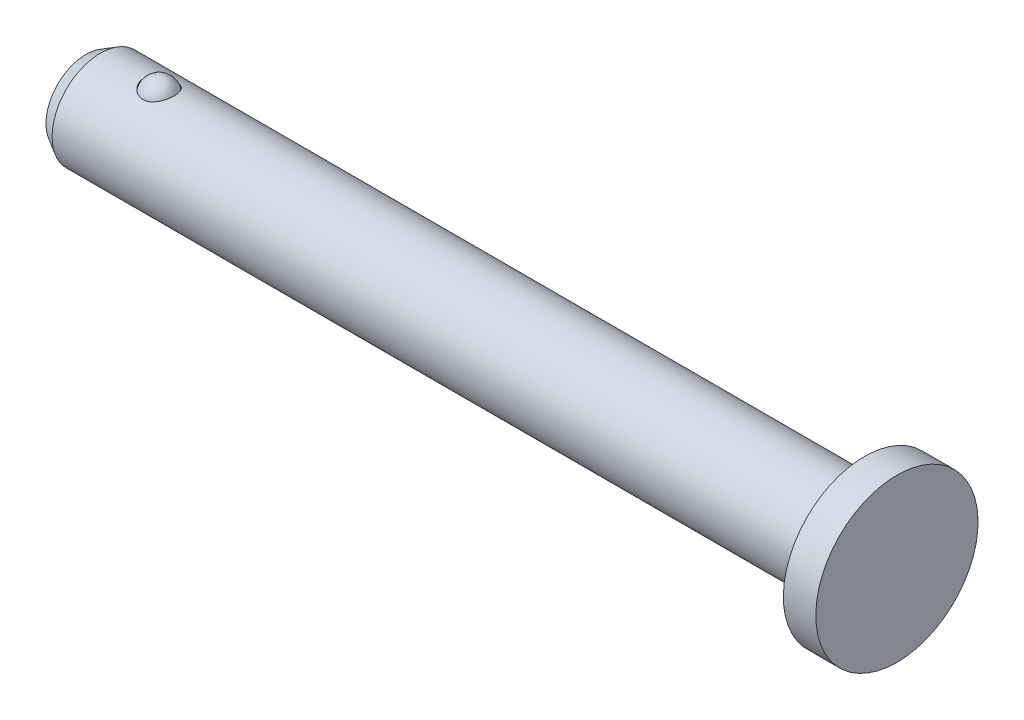
ISO-10303-21;
HEADER;
FILE_DESCRIPTION(('STEP AP214'),'2;1');
FILE_NAME('part.step','',(''),(''),'','','');
FILE_SCHEMA(('AUTOMOTIVE_DESIGN { 1 0 10303 214 1 1 1 1 }'));
ENDSEC;
DATA;
#1=APPLICATION_CONTEXT('core data for automotive mechanical design processes');
#2=APPLICATION_PROTOCOL_DEFINITION('international standard','automotive_design',2000,#1);
#3=PRODUCT_CONTEXT('',#1,'mechanical');
#4=PRODUCT('Part','Part','',(#3));
#5=PRODUCT_RELATED_PRODUCT_CATEGORY('part','',(#4));
#6=PRODUCT_DEFINITION_FORMATION('','',#4);
#7=PRODUCT_DEFINITION_CONTEXT('part definition',#1,'design');
#8=PRODUCT_DEFINITION('design','',#6,#7);
#9=PRODUCT_DEFINITION_SHAPE('','',#8);
#10=(LENGTH_UNIT() NAMED_UNIT(*) SI_UNIT(.MILLI.,.METRE.));
#11=(NAMED_UNIT(*) PLANE_ANGLE_UNIT() SI_UNIT($,.RADIAN.));
#12=(NAMED_UNIT(*) SI_UNIT($,.STERADIAN.) SOLID_ANGLE_UNIT());
#13=UNCERTAINTY_MEASURE_WITH_UNIT(LENGTH_MEASURE(1.E-05),#10,'distance_accuracy_value','');
#14=(GEOMETRIC_REPRESENTATION_CONTEXT(3) GLOBAL_UNCERTAINTY_ASSIGNED_CONTEXT((#13)) GLOBAL_UNIT_ASSIGNED_CONTEXT((#10,
#11,#12)) REPRESENTATION_CONTEXT('',''));
#15=CARTESIAN_POINT('',(0.,0.,0.));
#16=DIRECTION('',(0.,0.,1.));
#17=DIRECTION('',(1.,0.,0.));
#18=AXIS2_PLACEMENT_3D('',#15,#16,#17);
#19=CARTESIAN_POINT('',(-16.26235,2.02985730626251,0.));
#20=DIRECTION('',(-1.,0.,0.));
#21=DIRECTION('',(0.,1.,0.));
#22=AXIS2_PLACEMENT_3D('',#19,#20,#21);
#23=SPHERICAL_SURFACE('',#22,0.789542693737488);
#24=CARTESIAN_POINT('',(-17.0518926937375,2.02985730626251,0.));
#25=VERTEX_POINT('',#24);
#26=VERTEX_LOOP('',#25);
#27=FACE_BOUND('',#26,.T.);
#28=ADVANCED_FACE('F43',(#27),#23,.T.);
#29=CLOSED_SHELL('',(#28));
#30=MANIFOLD_SOLID_BREP('B2',#29);
#31=CARTESIAN_POINT('',(-19.84375,0.,0.));
#32=DIRECTION('',(-1.,0.,0.));
#33=DIRECTION('',(0.,-1.,0.));
#34=AXIS2_PLACEMENT_3D('',#31,#32,#33);
#35=CYLINDRICAL_SURFACE('',#34,2.3622);
#36=CARTESIAN_POINT('',(-19.13509,0.,0.));
#37=DIRECTION('',(-1.,0.,0.));
#38=DIRECTION('',(0.,-1.,0.));
#39=AXIS2_PLACEMENT_3D('',#36,#37,#38);
#40=CIRCLE('',#39,2.3622);
#41=CARTESIAN_POINT('',(-19.13509,-2.3622,0.));
#42=VERTEX_POINT('',#41);
#43=EDGE_CURVE('E68',#42,#42,#40,.T.);
#44=ORIENTED_EDGE('',*,*,#43,.F.);
#45=EDGE_LOOP('',(#44));
#46=FACE_BOUND('',#45,.T.);
#47=CARTESIAN_POINT('',(18.25625,0.,0.));
#48=DIRECTION('',(-1.,0.,0.));
#49=DIRECTION('',(0.,-1.,0.));
#50=AXIS2_PLACEMENT_3D('',#47,#48,#49);
#51=CIRCLE('',#50,2.3622);
#52=CARTESIAN_POINT('',(18.25625,-2.3622,0.));
#53=VERTEX_POINT('',#52);
#54=EDGE_CURVE('E42',#53,#53,#51,.T.);
#55=ORIENTED_EDGE('',*,*,#54,.T.);
#56=EDGE_LOOP('',(#55));
#57=FACE_BOUND('',#56,.T.);
#58=CARTESIAN_POINT('',(-16.26235,2.22581604673215,-0.791032089178223));
#59=CARTESIAN_POINT('',(-16.3018338222643,2.22581576398311,-0.791032519638611));
#60=CARTESIAN_POINT('',(-16.3413151384197,2.22697971671572,-0.787780239460781));
#61=CARTESIAN_POINT('',(-16.4190911852111,2.23149491079169,-0.774896744356571));
#62=CARTESIAN_POINT('',(-16.4573858392533,2.2348462930174,-0.765265118565097));
#63=CARTESIAN_POINT('',(-16.531633713184,2.24333848583653,-0.739997800068514));
#64=CARTESIAN_POINT('',(-16.5675913296129,2.24847581373636,-0.724373786774371));
#65=CARTESIAN_POINT('',(-16.6363604141592,2.25998083212617,-0.687636848342251));
#66=CARTESIAN_POINT('',(-16.6691713829049,2.26634871742328,-0.666523053944659));
#67=CARTESIAN_POINT('',(-16.7319315200548,2.27988127975237,-0.618680689218364));
#68=CARTESIAN_POINT('',(-16.7617565640189,2.28706485050395,-0.591794972427997));
#69=CARTESIAN_POINT('',(-16.8167458077474,2.30133787147743,-0.533600878356361));
#70=CARTESIAN_POINT('',(-16.8419088865026,2.30842729868224,-0.502291440535601));
#71=CARTESIAN_POINT('',(-16.88866080437,2.32229610981989,-0.433849997368858));
#72=CARTESIAN_POINT('',(-16.9099016466427,2.32902369976236,-0.396469482014573));
#73=CARTESIAN_POINT('',(-16.9462545129409,2.34094584755715,-0.318610784362622));
#74=CARTESIAN_POINT('',(-16.9613651181152,2.34614005042941,-0.278131887514646));
#75=CARTESIAN_POINT('',(-16.9857004779035,2.35466270542611,-0.193473280151713));
#76=CARTESIAN_POINT('',(-16.9946653937695,2.35790814356074,-0.149210288520306));
#77=CARTESIAN_POINT('',(-17.005565894284,2.36186996349137,-0.0597154884593794));
#78=CARTESIAN_POINT('',(-17.0075008699652,2.36258612618922,-0.0144835964404185));
#79=CARTESIAN_POINT('',(-17.0042909971991,2.36141021290238,0.0762430533264951));
#80=CARTESIAN_POINT('',(-16.9990605263757,2.35948659277288,0.121734407393892));
#81=CARTESIAN_POINT('',(-16.9814508372294,2.35317206611294,0.211137527329617));
#82=CARTESIAN_POINT('',(-16.9690713024393,2.34878105035866,0.255049223179882));
#83=CARTESIAN_POINT('',(-16.9373785333382,2.33799474034002,0.340003755419018));
#84=CARTESIAN_POINT('',(-16.9180697195014,2.33160072420233,0.381048400920879));
#85=CARTESIAN_POINT('',(-16.8728542738949,2.31749884585933,0.45908762846867));
#86=CARTESIAN_POINT('',(-16.8469476298871,2.30979098121703,0.49608220300213));
#87=CARTESIAN_POINT('',(-16.7895191404422,2.2940716483114,0.564297213422602));
#88=CARTESIAN_POINT('',(-16.7580957761656,2.28606718272386,0.595601988346434));
#89=CARTESIAN_POINT('',(-16.6900563583582,2.27059247122217,0.652119197807015));
#90=CARTESIAN_POINT('',(-16.6534418764304,2.26312206464838,0.677333470010342));
#91=CARTESIAN_POINT('',(-16.5779492741709,2.25001785060625,0.71963628712746));
#92=CARTESIAN_POINT('',(-16.5392775456061,2.24431058256401,0.737069660996988));
#93=CARTESIAN_POINT('',(-16.4592512672778,2.23497292980211,0.764920542936362));
#94=CARTESIAN_POINT('',(-16.4178981594483,2.23134143896186,0.775341788088755));
#95=CARTESIAN_POINT('',(-16.336791790642,2.22680429519513,0.788273335332939));
#96=CARTESIAN_POINT('',(-16.2971273529941,2.2257265947787,0.791283526133024));
#97=CARTESIAN_POINT('',(-16.2178529464748,2.2259171339851,0.790747912230158));
#98=CARTESIAN_POINT('',(-16.1782429675224,2.227184856437,0.787203552820129));
#99=CARTESIAN_POINT('',(-16.101593807461,2.23183155461559,0.773926866318529));
#100=CARTESIAN_POINT('',(-16.0645129744794,2.23513795566731,0.764407057193664));
#101=CARTESIAN_POINT('',(-15.9924941222932,2.24343404277332,0.739703383423264));
#102=CARTESIAN_POINT('',(-15.9575563106065,2.24842389153994,0.724518971254892));
#103=CARTESIAN_POINT('',(-15.8896511257475,2.25973866548061,0.688430400089751));
#104=CARTESIAN_POINT('',(-15.8567728995766,2.26609879126542,0.667369988967335));
#105=CARTESIAN_POINT('',(-15.7948539005421,2.27941389290418,0.620368260180016));
#106=CARTESIAN_POINT('',(-15.7658141812176,2.28636903120949,0.594425607222326));
#107=CARTESIAN_POINT('',(-15.7103363875522,2.30067315029258,0.53650441012868));
#108=CARTESIAN_POINT('',(-15.6841940827522,2.30801802589022,0.504241497413388));
#109=CARTESIAN_POINT('',(-15.6373294223548,2.3219066096982,0.435840003810781));
#110=CARTESIAN_POINT('',(-15.6166085654881,2.32845009610334,0.399700355105055));
#111=CARTESIAN_POINT('',(-15.5799154074514,2.34044485511105,0.32236581590907));
#112=CARTESIAN_POINT('',(-15.5642733166028,2.34581462134006,0.281001264451537));
#113=CARTESIAN_POINT('',(-15.5396525932013,2.35443088539652,0.19612297154861));
#114=CARTESIAN_POINT('',(-15.5306749478103,2.35767706866266,0.152608912728052));
#115=CARTESIAN_POINT('',(-15.5193857562819,2.36177692867522,0.0635170638966755));
#116=CARTESIAN_POINT('',(-15.5172440137684,2.36256964717617,0.017914843369445));
#117=CARTESIAN_POINT('',(-15.520139881845,2.3615088375365,-0.0730313594257119));
#118=CARTESIAN_POINT('',(-15.5251778997728,2.35965515925471,-0.118375326895324));
#119=CARTESIAN_POINT('',(-15.5423917858139,2.35347668943244,-0.20772830543412));
#120=CARTESIAN_POINT('',(-15.5545996260354,2.34914083140647,-0.251730402335729));
#121=CARTESIAN_POINT('',(-15.5859777734291,2.33844323829137,-0.33692140450069));
#122=CARTESIAN_POINT('',(-15.6051483348,2.33208142923882,-0.378110206989595));
#123=CARTESIAN_POINT('',(-15.6499743354645,2.31806542607961,-0.45620965136972));
#124=CARTESIAN_POINT('',(-15.6755888264204,2.31041949036449,-0.49314523746102));
#125=CARTESIAN_POINT('',(-15.7328670809521,2.29467177360045,-0.561885478042449));
#126=CARTESIAN_POINT('',(-15.7645302727704,2.28657003568757,-0.593690616967873));
#127=CARTESIAN_POINT('',(-15.8321103675284,2.27114006586694,-0.65018826947417));
#128=CARTESIAN_POINT('',(-15.8678630627565,2.26379555842983,-0.675072287191635));
#129=CARTESIAN_POINT('',(-15.9434509291089,2.25051576769323,-0.718107031490447));
#130=CARTESIAN_POINT('',(-15.9832838483709,2.24457971300892,-0.736261446834665));
#131=CARTESIAN_POINT('',(-16.0625351985796,2.23529527948482,-0.763964093369265));
#132=CARTESIAN_POINT('',(-16.1017351816544,2.2317787962283,-0.774081433169419));
#133=CARTESIAN_POINT('',(-16.1814079558051,2.22703972798425,-0.787614032349746));
#134=CARTESIAN_POINT('',(-16.221880294314,2.22581633654123,-0.791031647969541));
#135=CARTESIAN_POINT('',(-16.26235,2.22581604673215,-0.791032089178223));
#136=B_SPLINE_CURVE_WITH_KNOTS('',3,(#58,#59,#60,#61,#62,#63,#64,#65,#66,#67,#68,#69,#70,#71,
#72,#73,#74,#75,#76,#77,#78,#79,#80,#81,#82,#83,#84,#85,#86,#87,#88,#89,#90,#91,#92,#93,#94,#95,
#96,#97,#98,#99,#100,#101,#102,#103,#104,#105,#106,#107,#108,#109,#110,#111,#112,#113,#114,#115,
#116,#117,#118,#119,#120,#121,#122,#123,#124,#125,#126,#127,#128,#129,#130,#131,#132,#133,#134,
#135),.UNSPECIFIED.,.T.,.F.,(4,2,2,2,2,2,2,2,2,2,2,2,2,2,2,2,2,2,2,2,2,2,2,2,2,2,2,2,2,2,2,2,2,
2,2,2,2,2,4),(0.,0.118299361509042,0.23660634289136,0.354683901324836,0.472780167721935,
0.594630449676355,0.71650999364796,0.846477480289193,0.976475030932804,1.1116766565592,
1.24688999372125,1.38373321192028,1.52058248821508,1.65734461742628,1.79410700031297,
1.92863866932186,2.06312969570308,2.19085824756083,2.31851867302865,2.43729849240827,
2.55605212369601,2.6708045306772,2.78556803214263,2.90373452362426,3.02193338072497,
3.14788853933123,3.27387848087818,3.40691156896659,3.53996435847092,3.67629744685247,
3.81263827028837,3.94959173936421,4.08655020891101,4.22265943045033,4.35875579253439,
4.49059132495187,4.62235448583304,4.74365036609798,4.86490357990958),.UNSPECIFIED.);
#137=CARTESIAN_POINT('',(-16.26235,2.22581604673215,-0.791032089178223));
#138=VERTEX_POINT('',#137);
#139=EDGE_CURVE('E60',#138,#138,#136,.T.);
#140=ORIENTED_EDGE('',*,*,#139,.F.);
#141=EDGE_LOOP('',(#140));
#142=FACE_BOUND('',#141,.T.);
#143=ADVANCED_FACE('F56',(#46,#57,#142),#35,.T.);
#144=CARTESIAN_POINT('',(18.25625,2.3622,0.));
#145=DIRECTION('',(1.,0.,0.));
#146=DIRECTION('',(0.,1.,0.));
#147=AXIS2_PLACEMENT_3D('',#144,#145,#146);
#148=PLANE('',#147);
#149=ORIENTED_EDGE('',*,*,#54,.F.);
#150=EDGE_LOOP('',(#149));
#151=FACE_BOUND('',#150,.T.);
#152=CARTESIAN_POINT('',(18.25625,0.,0.));
#153=DIRECTION('',(-1.,0.,0.));
#154=DIRECTION('',(0.,-1.,0.));
#155=AXIS2_PLACEMENT_3D('',#152,#153,#154);
#156=CIRCLE('',#155,3.96874999999999);
#157=CARTESIAN_POINT('',(18.25625,-3.96874999999999,0.));
#158=VERTEX_POINT('',#157);
#159=EDGE_CURVE('E80',#158,#158,#156,.T.);
#160=ORIENTED_EDGE('',*,*,#159,.T.);
#161=EDGE_LOOP('',(#160));
#162=FACE_BOUND('',#161,.T.);
#163=ADVANCED_FACE('F58',(#151,#162),#148,.F.);
#164=CARTESIAN_POINT('',(-19.13509,0.,0.));
#165=DIRECTION('',(1.,0.,0.));
#166=DIRECTION('',(0.,1.,0.));
#167=AXIS2_PLACEMENT_3D('',#164,#165,#166);
#168=CONICAL_SURFACE('',#167,2.3622,0.523598775598301);
#169=CARTESIAN_POINT('',(-19.84375,0.,0.));
#170=DIRECTION('',(-1.,0.,0.));
#171=DIRECTION('',(0.,-1.,0.));
#172=AXIS2_PLACEMENT_3D('',#169,#170,#171);
#173=CIRCLE('',#172,1.95305495823607);
#174=CARTESIAN_POINT('',(-19.84375,-1.95305495823607,0.));
#175=VERTEX_POINT('',#174);
#176=EDGE_CURVE('E72',#175,#175,#173,.T.);
#177=ORIENTED_EDGE('',*,*,#176,.F.);
#178=EDGE_LOOP('',(#177));
#179=FACE_BOUND('',#178,.T.);
#180=ORIENTED_EDGE('',*,*,#43,.T.);
#181=EDGE_LOOP('',(#180));
#182=FACE_BOUND('',#181,.T.);
#183=ADVANCED_FACE('F94',(#179,#182),#168,.T.);
#184=CARTESIAN_POINT('',(-19.84375,1.95305495823607,0.));
#185=DIRECTION('',(1.,0.,0.));
#186=DIRECTION('',(0.,1.,0.));
#187=AXIS2_PLACEMENT_3D('',#184,#185,#186);
#188=PLANE('',#187);
#189=ORIENTED_EDGE('',*,*,#176,.T.);
#190=EDGE_LOOP('',(#189));
#191=FACE_BOUND('',#190,.T.);
#192=ADVANCED_FACE('F101',(#191),#188,.F.);
#193=CARTESIAN_POINT('',(19.84375,3.96874999999999,0.));
#194=DIRECTION('',(-1.,0.,0.));
#195=DIRECTION('',(0.,-1.,0.));
#196=AXIS2_PLACEMENT_3D('',#193,#194,#195);
#197=PLANE('',#196);
#198=CARTESIAN_POINT('',(19.84375,0.,0.));
#199=DIRECTION('',(-1.,0.,0.));
#200=DIRECTION('',(0.,-1.,0.));
#201=AXIS2_PLACEMENT_3D('',#198,#199,#200);
#202=CIRCLE('',#201,3.96874999999999);
#203=CARTESIAN_POINT('',(19.84375,-3.96874999999999,0.));
#204=VERTEX_POINT('',#203);
#205=EDGE_CURVE('E77',#204,#204,#202,.T.);
#206=ORIENTED_EDGE('',*,*,#205,.F.);
#207=EDGE_LOOP('',(#206));
#208=FACE_BOUND('',#207,.T.);
#209=ADVANCED_FACE('F105',(#208),#197,.F.);
#210=CARTESIAN_POINT('',(-19.84375,0.,0.));
#211=DIRECTION('',(-1.,0.,0.));
#212=DIRECTION('',(0.,-1.,0.));
#213=AXIS2_PLACEMENT_3D('',#210,#211,#212);
#214=CYLINDRICAL_SURFACE('',#213,3.96874999999999);
#215=ORIENTED_EDGE('',*,*,#159,.F.);
#216=EDGE_LOOP('',(#215));
#217=FACE_BOUND('',#216,.T.);
#218=ORIENTED_EDGE('',*,*,#205,.T.);
#219=EDGE_LOOP('',(#218));
#220=FACE_BOUND('',#219,.T.);
#221=ADVANCED_FACE('F109',(#217,#220),#214,.T.);
#222=CARTESIAN_POINT('',(-16.26235,2.02985730626251,0.));
#223=DIRECTION('',(-1.,0.,0.));
#224=DIRECTION('',(0.,1.,0.));
#225=AXIS2_PLACEMENT_3D('',#222,#223,#224);
#226=SPHERICAL_SURFACE('',#225,0.814942693737488);
#227=ORIENTED_EDGE('',*,*,#139,.T.);
#228=EDGE_LOOP('',(#227));
#229=FACE_BOUND('',#228,.T.);
#230=ADVANCED_FACE('F87',(#229),#226,.F.);
#231=CLOSED_SHELL('',(#143,#163,#183,#192,#209,#221,#230));
#232=MANIFOLD_SOLID_BREP('B6',#231);
#233=ADVANCED_BREP_SHAPE_REPRESENTATION('',(#18,#30,#232),#14);
#234=SHAPE_DEFINITION_REPRESENTATION(#9,#233);
ENDSEC;
END-ISO-10303-21;
